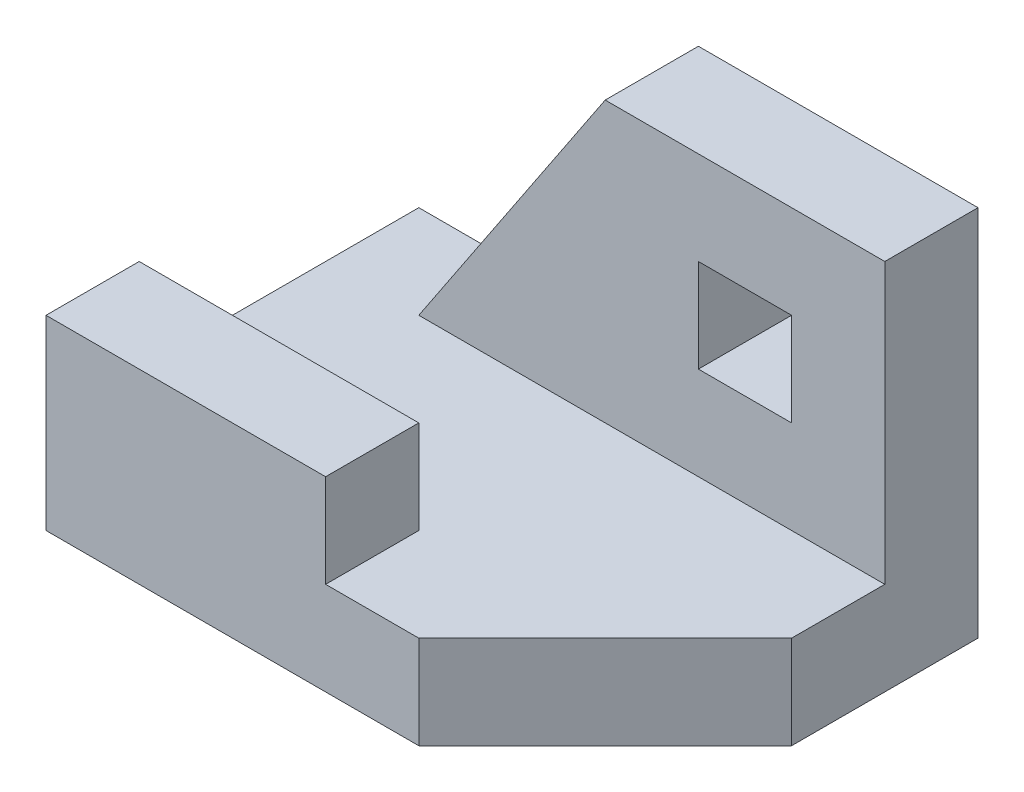
ISO-10303-21;
HEADER;
FILE_DESCRIPTION(('STEP AP214'),'2;1');
FILE_NAME('part.step','',(''),(''),'','','');
FILE_SCHEMA(('AUTOMOTIVE_DESIGN { 1 0 10303 214 1 1 1 1 }'));
ENDSEC;
DATA;
#1=APPLICATION_CONTEXT('core data for automotive mechanical design processes');
#2=APPLICATION_PROTOCOL_DEFINITION('international standard','automotive_design',2000,#1);
#3=PRODUCT_CONTEXT('',#1,'mechanical');
#4=PRODUCT('Part','Part','',(#3));
#5=PRODUCT_RELATED_PRODUCT_CATEGORY('part','',(#4));
#6=PRODUCT_DEFINITION_FORMATION('','',#4);
#7=PRODUCT_DEFINITION_CONTEXT('part definition',#1,'design');
#8=PRODUCT_DEFINITION('design','',#6,#7);
#9=PRODUCT_DEFINITION_SHAPE('','',#8);
#10=(LENGTH_UNIT() NAMED_UNIT(*) SI_UNIT(.MILLI.,.METRE.));
#11=(NAMED_UNIT(*) PLANE_ANGLE_UNIT() SI_UNIT($,.RADIAN.));
#12=(NAMED_UNIT(*) SI_UNIT($,.STERADIAN.) SOLID_ANGLE_UNIT());
#13=UNCERTAINTY_MEASURE_WITH_UNIT(LENGTH_MEASURE(1.E-05),#10,'distance_accuracy_value','');
#14=(GEOMETRIC_REPRESENTATION_CONTEXT(3) GLOBAL_UNCERTAINTY_ASSIGNED_CONTEXT((#13)) GLOBAL_UNIT_ASSIGNED_CONTEXT((#10,
#11,#12)) REPRESENTATION_CONTEXT('',''));
#15=CARTESIAN_POINT('',(0.,0.,0.));
#16=DIRECTION('',(0.,0.,1.));
#17=DIRECTION('',(1.,0.,0.));
#18=AXIS2_PLACEMENT_3D('',#15,#16,#17);
#19=CARTESIAN_POINT('',(0.,1.,0.));
#20=DIRECTION('',(0.,1.,0.));
#21=DIRECTION('',(0.,0.,1.));
#22=AXIS2_PLACEMENT_3D('',#19,#20,#21);
#23=PLANE('',#22);
#24=DIRECTION('',(-1.,0.,0.));
#25=VECTOR('',#24,1.);
#26=CARTESIAN_POINT('',(0.,1.,-3.));
#27=LINE('',#26,#25);
#28=CARTESIAN_POINT('',(6.,1.,-3.));
#29=VERTEX_POINT('',#28);
#30=CARTESIAN_POINT('',(1.,1.,-3.));
#31=VERTEX_POINT('',#30);
#32=EDGE_CURVE('E190',#29,#31,#27,.T.);
#33=ORIENTED_EDGE('',*,*,#32,.T.);
#34=DIRECTION('',(0.,0.,-1.));
#35=VECTOR('',#34,1.);
#36=CARTESIAN_POINT('',(1.,1.,0.));
#37=LINE('',#36,#35);
#38=CARTESIAN_POINT('',(1.,1.,-4.));
#39=VERTEX_POINT('',#38);
#40=EDGE_CURVE('E193',#31,#39,#37,.T.);
#41=ORIENTED_EDGE('',*,*,#40,.T.);
#42=DIRECTION('',(1.,0.,0.));
#43=VECTOR('',#42,1.);
#44=CARTESIAN_POINT('',(0.,1.,-4.));
#45=LINE('',#44,#43);
#46=CARTESIAN_POINT('',(0.,1.,-4.));
#47=VERTEX_POINT('',#46);
#48=EDGE_CURVE('E223',#47,#39,#45,.T.);
#49=ORIENTED_EDGE('',*,*,#48,.F.);
#50=DIRECTION('',(0.,0.,-1.));
#51=VECTOR('',#50,1.);
#52=CARTESIAN_POINT('',(0.,1.,0.));
#53=LINE('',#52,#51);
#54=CARTESIAN_POINT('',(0.,1.,-1.));
#55=VERTEX_POINT('',#54);
#56=EDGE_CURVE('E226',#55,#47,#53,.T.);
#57=ORIENTED_EDGE('',*,*,#56,.F.);
#58=DIRECTION('',(-1.,0.,0.));
#59=VECTOR('',#58,1.);
#60=CARTESIAN_POINT('',(0.,1.,-1.));
#61=LINE('',#60,#59);
#62=CARTESIAN_POINT('',(3.,1.,-1.));
#63=VERTEX_POINT('',#62);
#64=EDGE_CURVE('E216',#63,#55,#61,.T.);
#65=ORIENTED_EDGE('',*,*,#64,.F.);
#66=DIRECTION('',(0.,0.,-1.));
#67=VECTOR('',#66,1.);
#68=CARTESIAN_POINT('',(3.,1.,0.));
#69=LINE('',#68,#67);
#70=CARTESIAN_POINT('',(3.,1.,0.));
#71=VERTEX_POINT('',#70);
#72=EDGE_CURVE('E219',#71,#63,#69,.T.);
#73=ORIENTED_EDGE('',*,*,#72,.F.);
#74=DIRECTION('',(1.,0.,0.));
#75=VECTOR('',#74,1.);
#76=CARTESIAN_POINT('',(0.,1.,0.));
#77=LINE('',#76,#75);
#78=CARTESIAN_POINT('',(4.,1.,0.));
#79=VERTEX_POINT('',#78);
#80=EDGE_CURVE('E229',#71,#79,#77,.T.);
#81=ORIENTED_EDGE('',*,*,#80,.T.);
#82=DIRECTION('',(0.707106781186547,0.,-0.707106781186548));
#83=VECTOR('',#82,1.);
#84=CARTESIAN_POINT('',(2.,1.,2.));
#85=LINE('',#84,#83);
#86=CARTESIAN_POINT('',(6.,1.,-2.));
#87=VERTEX_POINT('',#86);
#88=EDGE_CURVE('E231',#79,#87,#85,.T.);
#89=ORIENTED_EDGE('',*,*,#88,.T.);
#90=DIRECTION('',(0.,0.,-1.));
#91=VECTOR('',#90,1.);
#92=CARTESIAN_POINT('',(6.,1.,0.));
#93=LINE('',#92,#91);
#94=EDGE_CURVE('E233',#87,#29,#93,.T.);
#95=ORIENTED_EDGE('',*,*,#94,.T.);
#96=EDGE_LOOP('',(#33,#41,#49,#57,#65,#73,#81,#89,#95));
#97=FACE_BOUND('',#96,.T.);
#98=ADVANCED_FACE('F35',(#97),#23,.T.);
#99=CARTESIAN_POINT('',(0.,1.,-4.));
#100=DIRECTION('',(0.,0.,-1.));
#101=DIRECTION('',(-1.,0.,0.));
#102=AXIS2_PLACEMENT_3D('',#99,#100,#101);
#103=PLANE('',#102);
#104=DIRECTION('',(0.,-1.,0.));
#105=VECTOR('',#104,1.);
#106=CARTESIAN_POINT('',(5.,1.,-4.));
#107=LINE('',#106,#105);
#108=CARTESIAN_POINT('',(5.,3.,-4.));
#109=VERTEX_POINT('',#108);
#110=CARTESIAN_POINT('',(5.,2.,-4.));
#111=VERTEX_POINT('',#110);
#112=EDGE_CURVE('E178',#109,#111,#107,.T.);
#113=ORIENTED_EDGE('',*,*,#112,.F.);
#114=DIRECTION('',(1.,0.,0.));
#115=VECTOR('',#114,1.);
#116=CARTESIAN_POINT('',(0.,3.,-4.));
#117=LINE('',#116,#115);
#118=CARTESIAN_POINT('',(4.,3.,-4.));
#119=VERTEX_POINT('',#118);
#120=EDGE_CURVE('E173',#119,#109,#117,.T.);
#121=ORIENTED_EDGE('',*,*,#120,.F.);
#122=DIRECTION('',(0.,1.,0.));
#123=VECTOR('',#122,1.);
#124=CARTESIAN_POINT('',(4.,1.,-4.));
#125=LINE('',#124,#123);
#126=CARTESIAN_POINT('',(4.,2.,-4.));
#127=VERTEX_POINT('',#126);
#128=EDGE_CURVE('E147',#127,#119,#125,.T.);
#129=ORIENTED_EDGE('',*,*,#128,.F.);
#130=DIRECTION('',(-1.,0.,0.));
#131=VECTOR('',#130,1.);
#132=CARTESIAN_POINT('',(0.,2.,-4.));
#133=LINE('',#132,#131);
#134=EDGE_CURVE('E176',#111,#127,#133,.T.);
#135=ORIENTED_EDGE('',*,*,#134,.F.);
#136=EDGE_LOOP('',(#113,#121,#129,#135));
#137=FACE_BOUND('',#136,.T.);
#138=DIRECTION('',(-0.554700196225229,-0.832050294337844,0.));
#139=VECTOR('',#138,1.);
#140=CARTESIAN_POINT('',(0.692307692307694,0.538461538461538,-4.));
#141=LINE('',#140,#139);
#142=CARTESIAN_POINT('',(3.,4.,-4.));
#143=VERTEX_POINT('',#142);
#144=EDGE_CURVE('E167',#143,#39,#141,.T.);
#145=ORIENTED_EDGE('',*,*,#144,.F.);
#146=DIRECTION('',(1.,0.,0.));
#147=VECTOR('',#146,1.);
#148=CARTESIAN_POINT('',(0.,4.,-4.));
#149=LINE('',#148,#147);
#150=CARTESIAN_POINT('',(6.,4.,-4.));
#151=VERTEX_POINT('',#150);
#152=EDGE_CURVE('E185',#143,#151,#149,.T.);
#153=ORIENTED_EDGE('',*,*,#152,.T.);
#154=DIRECTION('',(0.,-1.,0.));
#155=VECTOR('',#154,1.);
#156=CARTESIAN_POINT('',(6.,1.,-4.));
#157=LINE('',#156,#155);
#158=CARTESIAN_POINT('',(6.,0.,-4.));
#159=VERTEX_POINT('',#158);
#160=EDGE_CURVE('E236',#151,#159,#157,.T.);
#161=ORIENTED_EDGE('',*,*,#160,.T.);
#162=DIRECTION('',(1.,0.,0.));
#163=VECTOR('',#162,1.);
#164=CARTESIAN_POINT('',(0.,0.,-4.));
#165=LINE('',#164,#163);
#166=CARTESIAN_POINT('',(0.,0.,-4.));
#167=VERTEX_POINT('',#166);
#168=EDGE_CURVE('E222',#167,#159,#165,.T.);
#169=ORIENTED_EDGE('',*,*,#168,.F.);
#170=DIRECTION('',(0.,-1.,0.));
#171=VECTOR('',#170,1.);
#172=CARTESIAN_POINT('',(0.,1.,-4.));
#173=LINE('',#172,#171);
#174=EDGE_CURVE('E43',#47,#167,#173,.T.);
#175=ORIENTED_EDGE('',*,*,#174,.F.);
#176=ORIENTED_EDGE('',*,*,#48,.T.);
#177=EDGE_LOOP('',(#145,#153,#161,#169,#175,#176));
#178=FACE_BOUND('',#177,.T.);
#179=ADVANCED_FACE('F37',(#137,#178),#103,.T.);
#180=CARTESIAN_POINT('',(0.,1.,0.));
#181=DIRECTION('',(-1.,0.,0.));
#182=DIRECTION('',(0.,0.,1.));
#183=AXIS2_PLACEMENT_3D('',#180,#181,#182);
#184=PLANE('',#183);
#185=ORIENTED_EDGE('',*,*,#174,.T.);
#186=DIRECTION('',(0.,0.,-1.));
#187=VECTOR('',#186,1.);
#188=CARTESIAN_POINT('',(0.,0.,0.));
#189=LINE('',#188,#187);
#190=CARTESIAN_POINT('',(0.,0.,0.));
#191=VERTEX_POINT('',#190);
#192=EDGE_CURVE('E239',#191,#167,#189,.T.);
#193=ORIENTED_EDGE('',*,*,#192,.F.);
#194=DIRECTION('',(0.,-1.,0.));
#195=VECTOR('',#194,1.);
#196=CARTESIAN_POINT('',(0.,1.,0.));
#197=LINE('',#196,#195);
#198=CARTESIAN_POINT('',(0.,2.,0.));
#199=VERTEX_POINT('',#198);
#200=EDGE_CURVE('E254',#199,#191,#197,.T.);
#201=ORIENTED_EDGE('',*,*,#200,.F.);
#202=DIRECTION('',(0.,0.,-1.));
#203=VECTOR('',#202,1.);
#204=CARTESIAN_POINT('',(0.,2.,0.));
#205=LINE('',#204,#203);
#206=CARTESIAN_POINT('',(0.,2.,-1.));
#207=VERTEX_POINT('',#206);
#208=EDGE_CURVE('E202',#199,#207,#205,.T.);
#209=ORIENTED_EDGE('',*,*,#208,.T.);
#210=DIRECTION('',(0.,-1.,0.));
#211=VECTOR('',#210,1.);
#212=CARTESIAN_POINT('',(0.,2.,-1.));
#213=LINE('',#212,#211);
#214=EDGE_CURVE('E210',#207,#55,#213,.T.);
#215=ORIENTED_EDGE('',*,*,#214,.T.);
#216=ORIENTED_EDGE('',*,*,#56,.T.);
#217=EDGE_LOOP('',(#185,#193,#201,#209,#215,#216));
#218=FACE_BOUND('',#217,.T.);
#219=ADVANCED_FACE('F260',(#218),#184,.T.);
#220=CARTESIAN_POINT('',(0.,1.,0.));
#221=DIRECTION('',(0.,0.,-1.));
#222=DIRECTION('',(-1.,0.,0.));
#223=AXIS2_PLACEMENT_3D('',#220,#221,#222);
#224=PLANE('',#223);
#225=ORIENTED_EDGE('',*,*,#80,.F.);
#226=DIRECTION('',(0.,-1.,0.));
#227=VECTOR('',#226,1.);
#228=CARTESIAN_POINT('',(3.,2.,0.));
#229=LINE('',#228,#227);
#230=CARTESIAN_POINT('',(3.,2.,0.));
#231=VERTEX_POINT('',#230);
#232=EDGE_CURVE('E207',#231,#71,#229,.T.);
#233=ORIENTED_EDGE('',*,*,#232,.F.);
#234=DIRECTION('',(1.,0.,0.));
#235=VECTOR('',#234,1.);
#236=CARTESIAN_POINT('',(0.,2.,0.));
#237=LINE('',#236,#235);
#238=EDGE_CURVE('E205',#199,#231,#237,.T.);
#239=ORIENTED_EDGE('',*,*,#238,.F.);
#240=ORIENTED_EDGE('',*,*,#200,.T.);
#241=DIRECTION('',(1.,0.,0.));
#242=VECTOR('',#241,1.);
#243=CARTESIAN_POINT('',(0.,0.,0.));
#244=LINE('',#243,#242);
#245=CARTESIAN_POINT('',(4.,0.,0.));
#246=VERTEX_POINT('',#245);
#247=EDGE_CURVE('E241',#191,#246,#244,.T.);
#248=ORIENTED_EDGE('',*,*,#247,.T.);
#249=DIRECTION('',(0.,-1.,0.));
#250=VECTOR('',#249,1.);
#251=CARTESIAN_POINT('',(4.,1.,0.));
#252=LINE('',#251,#250);
#253=EDGE_CURVE('E251',#79,#246,#252,.T.);
#254=ORIENTED_EDGE('',*,*,#253,.F.);
#255=EDGE_LOOP('',(#225,#233,#239,#240,#248,#254));
#256=FACE_BOUND('',#255,.T.);
#257=ADVANCED_FACE('F272',(#256),#224,.F.);
#258=CARTESIAN_POINT('',(2.,1.,2.));
#259=DIRECTION('',(-0.707106781186548,0.,-0.707106781186547));
#260=DIRECTION('',(-0.707106781186547,0.,0.707106781186548));
#261=AXIS2_PLACEMENT_3D('',#258,#259,#260);
#262=PLANE('',#261);
#263=DIRECTION('',(0.707106781186547,0.,-0.707106781186548));
#264=VECTOR('',#263,1.);
#265=CARTESIAN_POINT('',(2.,0.,2.));
#266=LINE('',#265,#264);
#267=CARTESIAN_POINT('',(6.,0.,-2.));
#268=VERTEX_POINT('',#267);
#269=EDGE_CURVE('E243',#246,#268,#266,.T.);
#270=ORIENTED_EDGE('',*,*,#269,.T.);
#271=DIRECTION('',(0.,-1.,0.));
#272=VECTOR('',#271,1.);
#273=CARTESIAN_POINT('',(6.,1.,-2.));
#274=LINE('',#273,#272);
#275=EDGE_CURVE('E248',#87,#268,#274,.T.);
#276=ORIENTED_EDGE('',*,*,#275,.F.);
#277=ORIENTED_EDGE('',*,*,#88,.F.);
#278=ORIENTED_EDGE('',*,*,#253,.T.);
#279=EDGE_LOOP('',(#270,#276,#277,#278));
#280=FACE_BOUND('',#279,.T.);
#281=ADVANCED_FACE('F276',(#280),#262,.F.);
#282=CARTESIAN_POINT('',(6.,1.,0.));
#283=DIRECTION('',(-1.,0.,0.));
#284=DIRECTION('',(0.,0.,1.));
#285=AXIS2_PLACEMENT_3D('',#282,#283,#284);
#286=PLANE('',#285);
#287=ORIENTED_EDGE('',*,*,#160,.F.);
#288=DIRECTION('',(0.,0.,-1.));
#289=VECTOR('',#288,1.);
#290=CARTESIAN_POINT('',(6.,4.,0.));
#291=LINE('',#290,#289);
#292=CARTESIAN_POINT('',(6.,4.,-3.));
#293=VERTEX_POINT('',#292);
#294=EDGE_CURVE('E182',#293,#151,#291,.T.);
#295=ORIENTED_EDGE('',*,*,#294,.F.);
#296=DIRECTION('',(0.,-1.,0.));
#297=VECTOR('',#296,1.);
#298=CARTESIAN_POINT('',(6.,4.,-3.));
#299=LINE('',#298,#297);
#300=EDGE_CURVE('E187',#293,#29,#299,.T.);
#301=ORIENTED_EDGE('',*,*,#300,.T.);
#302=ORIENTED_EDGE('',*,*,#94,.F.);
#303=ORIENTED_EDGE('',*,*,#275,.T.);
#304=DIRECTION('',(0.,0.,-1.));
#305=VECTOR('',#304,1.);
#306=CARTESIAN_POINT('',(6.,0.,0.));
#307=LINE('',#306,#305);
#308=EDGE_CURVE('E227',#268,#159,#307,.T.);
#309=ORIENTED_EDGE('',*,*,#308,.T.);
#310=EDGE_LOOP('',(#287,#295,#301,#302,#303,#309));
#311=FACE_BOUND('',#310,.T.);
#312=ADVANCED_FACE('F300',(#311),#286,.F.);
#313=CARTESIAN_POINT('',(0.,0.,0.));
#314=DIRECTION('',(0.,1.,0.));
#315=DIRECTION('',(0.,0.,1.));
#316=AXIS2_PLACEMENT_3D('',#313,#314,#315);
#317=PLANE('',#316);
#318=ORIENTED_EDGE('',*,*,#168,.T.);
#319=ORIENTED_EDGE('',*,*,#308,.F.);
#320=ORIENTED_EDGE('',*,*,#269,.F.);
#321=ORIENTED_EDGE('',*,*,#247,.F.);
#322=ORIENTED_EDGE('',*,*,#192,.T.);
#323=EDGE_LOOP('',(#318,#319,#320,#321,#322));
#324=FACE_BOUND('',#323,.T.);
#325=ADVANCED_FACE('F267',(#324),#317,.F.);
#326=CARTESIAN_POINT('',(3.,2.,0.));
#327=DIRECTION('',(1.,0.,0.));
#328=DIRECTION('',(0.,0.,-1.));
#329=AXIS2_PLACEMENT_3D('',#326,#327,#328);
#330=PLANE('',#329);
#331=ORIENTED_EDGE('',*,*,#232,.T.);
#332=ORIENTED_EDGE('',*,*,#72,.T.);
#333=DIRECTION('',(0.,-1.,0.));
#334=VECTOR('',#333,1.);
#335=CARTESIAN_POINT('',(3.,2.,-1.));
#336=LINE('',#335,#334);
#337=CARTESIAN_POINT('',(3.,2.,-1.));
#338=VERTEX_POINT('',#337);
#339=EDGE_CURVE('E213',#338,#63,#336,.T.);
#340=ORIENTED_EDGE('',*,*,#339,.F.);
#341=DIRECTION('',(0.,0.,1.));
#342=VECTOR('',#341,1.);
#343=CARTESIAN_POINT('',(3.,2.,0.));
#344=LINE('',#343,#342);
#345=EDGE_CURVE('E196',#338,#231,#344,.T.);
#346=ORIENTED_EDGE('',*,*,#345,.T.);
#347=EDGE_LOOP('',(#331,#332,#340,#346));
#348=FACE_BOUND('',#347,.T.);
#349=ADVANCED_FACE('F285',(#348),#330,.T.);
#350=CARTESIAN_POINT('',(0.,2.,-1.));
#351=DIRECTION('',(0.,0.,-1.));
#352=DIRECTION('',(-1.,0.,0.));
#353=AXIS2_PLACEMENT_3D('',#350,#351,#352);
#354=PLANE('',#353);
#355=ORIENTED_EDGE('',*,*,#339,.T.);
#356=ORIENTED_EDGE('',*,*,#64,.T.);
#357=ORIENTED_EDGE('',*,*,#214,.F.);
#358=DIRECTION('',(1.,0.,0.));
#359=VECTOR('',#358,1.);
#360=CARTESIAN_POINT('',(0.,2.,-1.));
#361=LINE('',#360,#359);
#362=EDGE_CURVE('E199',#207,#338,#361,.T.);
#363=ORIENTED_EDGE('',*,*,#362,.T.);
#364=EDGE_LOOP('',(#355,#356,#357,#363));
#365=FACE_BOUND('',#364,.T.);
#366=ADVANCED_FACE('F290',(#365),#354,.T.);
#367=CARTESIAN_POINT('',(0.,2.,0.));
#368=DIRECTION('',(0.,1.,0.));
#369=DIRECTION('',(0.,0.,1.));
#370=AXIS2_PLACEMENT_3D('',#367,#368,#369);
#371=PLANE('',#370);
#372=ORIENTED_EDGE('',*,*,#345,.F.);
#373=ORIENTED_EDGE('',*,*,#362,.F.);
#374=ORIENTED_EDGE('',*,*,#208,.F.);
#375=ORIENTED_EDGE('',*,*,#238,.T.);
#376=EDGE_LOOP('',(#372,#373,#374,#375));
#377=FACE_BOUND('',#376,.T.);
#378=ADVANCED_FACE('F288',(#377),#371,.T.);
#379=CARTESIAN_POINT('',(0.,4.,-3.));
#380=DIRECTION('',(0.,0.,-1.));
#381=DIRECTION('',(-1.,0.,0.));
#382=AXIS2_PLACEMENT_3D('',#379,#380,#381);
#383=PLANE('',#382);
#384=DIRECTION('',(-1.,0.,0.));
#385=VECTOR('',#384,1.);
#386=CARTESIAN_POINT('',(4.,3.,-3.));
#387=LINE('',#386,#385);
#388=CARTESIAN_POINT('',(5.,3.,-3.));
#389=VERTEX_POINT('',#388);
#390=CARTESIAN_POINT('',(4.,3.,-3.));
#391=VERTEX_POINT('',#390);
#392=EDGE_CURVE('E153',#389,#391,#387,.T.);
#393=ORIENTED_EDGE('',*,*,#392,.F.);
#394=DIRECTION('',(0.,1.,0.));
#395=VECTOR('',#394,1.);
#396=CARTESIAN_POINT('',(5.,2.,-3.));
#397=LINE('',#396,#395);
#398=CARTESIAN_POINT('',(5.,2.,-3.));
#399=VERTEX_POINT('',#398);
#400=EDGE_CURVE('E58',#399,#389,#397,.T.);
#401=ORIENTED_EDGE('',*,*,#400,.F.);
#402=DIRECTION('',(1.,0.,0.));
#403=VECTOR('',#402,1.);
#404=CARTESIAN_POINT('',(4.,2.,-3.));
#405=LINE('',#404,#403);
#406=CARTESIAN_POINT('',(4.,2.,-3.));
#407=VERTEX_POINT('',#406);
#408=EDGE_CURVE('E160',#407,#399,#405,.T.);
#409=ORIENTED_EDGE('',*,*,#408,.F.);
#410=DIRECTION('',(0.,-1.,0.));
#411=VECTOR('',#410,1.);
#412=CARTESIAN_POINT('',(4.,2.,-3.));
#413=LINE('',#412,#411);
#414=EDGE_CURVE('E144',#391,#407,#413,.T.);
#415=ORIENTED_EDGE('',*,*,#414,.F.);
#416=EDGE_LOOP('',(#393,#401,#409,#415));
#417=FACE_BOUND('',#416,.T.);
#418=DIRECTION('',(1.,0.,0.));
#419=VECTOR('',#418,1.);
#420=CARTESIAN_POINT('',(0.,4.,-3.));
#421=LINE('',#420,#419);
#422=CARTESIAN_POINT('',(3.,4.,-3.));
#423=VERTEX_POINT('',#422);
#424=EDGE_CURVE('E180',#423,#293,#421,.T.);
#425=ORIENTED_EDGE('',*,*,#424,.F.);
#426=DIRECTION('',(0.554700196225229,0.832050294337844,0.));
#427=VECTOR('',#426,1.);
#428=CARTESIAN_POINT('',(3.,4.,-3.));
#429=LINE('',#428,#427);
#430=EDGE_CURVE('E170',#31,#423,#429,.T.);
#431=ORIENTED_EDGE('',*,*,#430,.F.);
#432=ORIENTED_EDGE('',*,*,#32,.F.);
#433=ORIENTED_EDGE('',*,*,#300,.F.);
#434=EDGE_LOOP('',(#425,#431,#432,#433));
#435=FACE_BOUND('',#434,.T.);
#436=ADVANCED_FACE('F157',(#417,#435),#383,.F.);
#437=CARTESIAN_POINT('',(0.,4.,0.));
#438=DIRECTION('',(0.,1.,0.));
#439=DIRECTION('',(0.,0.,1.));
#440=AXIS2_PLACEMENT_3D('',#437,#438,#439);
#441=PLANE('',#440);
#442=DIRECTION('',(0.,0.,-1.));
#443=VECTOR('',#442,1.);
#444=CARTESIAN_POINT('',(3.,4.,0.));
#445=LINE('',#444,#443);
#446=EDGE_CURVE('E11',#423,#143,#445,.T.);
#447=ORIENTED_EDGE('',*,*,#446,.F.);
#448=ORIENTED_EDGE('',*,*,#424,.T.);
#449=ORIENTED_EDGE('',*,*,#294,.T.);
#450=ORIENTED_EDGE('',*,*,#152,.F.);
#451=EDGE_LOOP('',(#447,#448,#449,#450));
#452=FACE_BOUND('',#451,.T.);
#453=ADVANCED_FACE('F295',(#452),#441,.T.);
#454=CARTESIAN_POINT('',(3.,4.,-7.));
#455=DIRECTION('',(0.832050294337844,-0.554700196225229,0.));
#456=DIRECTION('',(0.554700196225229,0.832050294337844,0.));
#457=AXIS2_PLACEMENT_3D('',#454,#455,#456);
#458=PLANE('',#457);
#459=ORIENTED_EDGE('',*,*,#144,.T.);
#460=ORIENTED_EDGE('',*,*,#40,.F.);
#461=ORIENTED_EDGE('',*,*,#430,.T.);
#462=ORIENTED_EDGE('',*,*,#446,.T.);
#463=EDGE_LOOP('',(#459,#460,#461,#462));
#464=FACE_BOUND('',#463,.T.);
#465=ADVANCED_FACE('F302',(#464),#458,.F.);
#466=CARTESIAN_POINT('',(5.,2.,-7.));
#467=DIRECTION('',(1.,0.,0.));
#468=DIRECTION('',(0.,0.,-1.));
#469=AXIS2_PLACEMENT_3D('',#466,#467,#468);
#470=PLANE('',#469);
#471=ORIENTED_EDGE('',*,*,#112,.T.);
#472=DIRECTION('',(0.,0.,1.));
#473=VECTOR('',#472,1.);
#474=CARTESIAN_POINT('',(5.,2.,-7.));
#475=LINE('',#474,#473);
#476=EDGE_CURVE('E165',#111,#399,#475,.T.);
#477=ORIENTED_EDGE('',*,*,#476,.T.);
#478=ORIENTED_EDGE('',*,*,#400,.T.);
#479=DIRECTION('',(0.,0.,1.));
#480=VECTOR('',#479,1.);
#481=CARTESIAN_POINT('',(5.,3.,-7.));
#482=LINE('',#481,#480);
#483=EDGE_CURVE('E150',#109,#389,#482,.T.);
#484=ORIENTED_EDGE('',*,*,#483,.F.);
#485=EDGE_LOOP('',(#471,#477,#478,#484));
#486=FACE_BOUND('',#485,.T.);
#487=ADVANCED_FACE('F304',(#486),#470,.F.);
#488=CARTESIAN_POINT('',(4.,2.,-7.));
#489=DIRECTION('',(0.,-1.,0.));
#490=DIRECTION('',(0.,0.,-1.));
#491=AXIS2_PLACEMENT_3D('',#488,#489,#490);
#492=PLANE('',#491);
#493=ORIENTED_EDGE('',*,*,#134,.T.);
#494=DIRECTION('',(0.,0.,1.));
#495=VECTOR('',#494,1.);
#496=CARTESIAN_POINT('',(4.,2.,-7.));
#497=LINE('',#496,#495);
#498=EDGE_CURVE('E149',#127,#407,#497,.T.);
#499=ORIENTED_EDGE('',*,*,#498,.T.);
#500=ORIENTED_EDGE('',*,*,#408,.T.);
#501=ORIENTED_EDGE('',*,*,#476,.F.);
#502=EDGE_LOOP('',(#493,#499,#500,#501));
#503=FACE_BOUND('',#502,.T.);
#504=ADVANCED_FACE('F310',(#503),#492,.F.);
#505=CARTESIAN_POINT('',(4.,2.,-7.));
#506=DIRECTION('',(-1.,0.,0.));
#507=DIRECTION('',(0.,0.,1.));
#508=AXIS2_PLACEMENT_3D('',#505,#506,#507);
#509=PLANE('',#508);
#510=ORIENTED_EDGE('',*,*,#128,.T.);
#511=DIRECTION('',(0.,0.,1.));
#512=VECTOR('',#511,1.);
#513=CARTESIAN_POINT('',(4.,3.,-7.));
#514=LINE('',#513,#512);
#515=EDGE_CURVE('E50',#119,#391,#514,.T.);
#516=ORIENTED_EDGE('',*,*,#515,.T.);
#517=ORIENTED_EDGE('',*,*,#414,.T.);
#518=ORIENTED_EDGE('',*,*,#498,.F.);
#519=EDGE_LOOP('',(#510,#516,#517,#518));
#520=FACE_BOUND('',#519,.T.);
#521=ADVANCED_FACE('F141',(#520),#509,.F.);
#522=CARTESIAN_POINT('',(4.,3.,-7.));
#523=DIRECTION('',(0.,1.,0.));
#524=DIRECTION('',(0.,0.,1.));
#525=AXIS2_PLACEMENT_3D('',#522,#523,#524);
#526=PLANE('',#525);
#527=ORIENTED_EDGE('',*,*,#120,.T.);
#528=ORIENTED_EDGE('',*,*,#483,.T.);
#529=ORIENTED_EDGE('',*,*,#392,.T.);
#530=ORIENTED_EDGE('',*,*,#515,.F.);
#531=EDGE_LOOP('',(#527,#528,#529,#530));
#532=FACE_BOUND('',#531,.T.);
#533=ADVANCED_FACE('F154',(#532),#526,.F.);
#534=CLOSED_SHELL('',(#98,#179,#219,#257,#281,#312,#325,#349,#366,#378,#436,#453,#465,#487,#504,
#521,#533));
#535=MANIFOLD_SOLID_BREP('B2',#534);
#536=ADVANCED_BREP_SHAPE_REPRESENTATION('',(#18,#535),#14);
#537=SHAPE_DEFINITION_REPRESENTATION(#9,#536);
ENDSEC;
END-ISO-10303-21;
